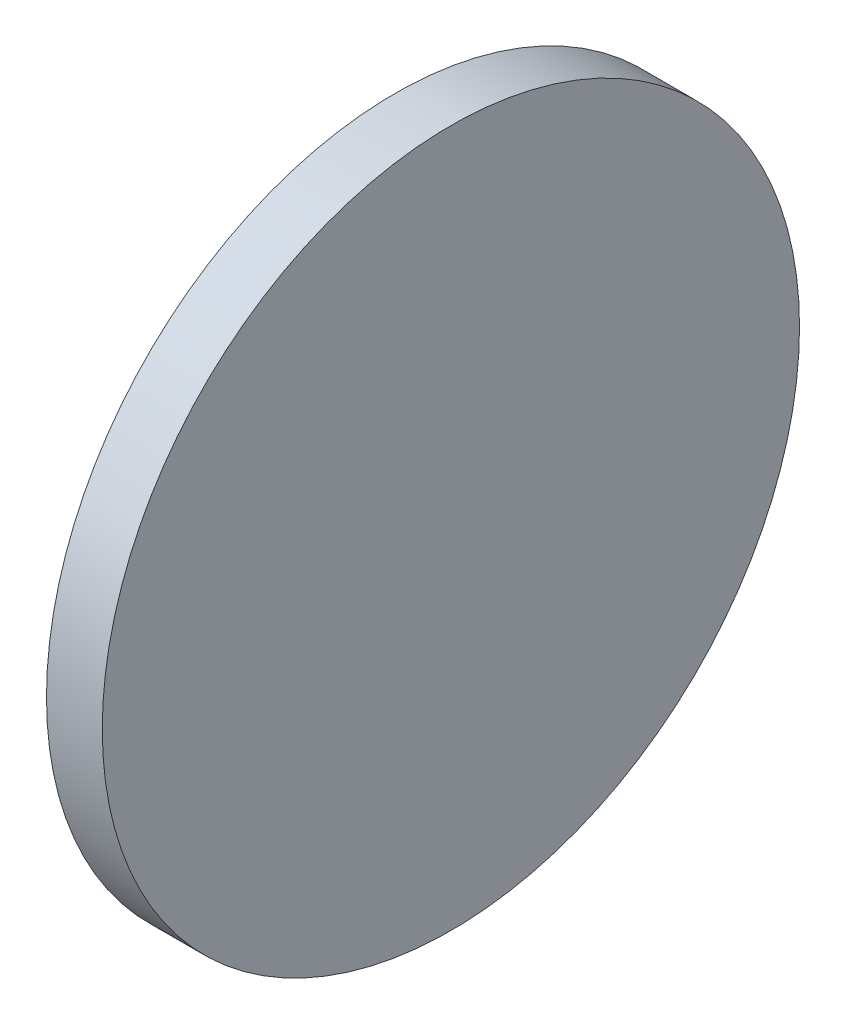
ISO-10303-21;
HEADER;
FILE_DESCRIPTION(('STEP AP214'),'2;1');
FILE_NAME('part.step','',(''),(''),'','','');
FILE_SCHEMA(('AUTOMOTIVE_DESIGN { 1 0 10303 214 1 1 1 1 }'));
ENDSEC;
DATA;
#1=APPLICATION_CONTEXT('core data for automotive mechanical design processes');
#2=APPLICATION_PROTOCOL_DEFINITION('international standard','automotive_design',2000,#1);
#3=PRODUCT_CONTEXT('',#1,'mechanical');
#4=PRODUCT('Part','Part','',(#3));
#5=PRODUCT_RELATED_PRODUCT_CATEGORY('part','',(#4));
#6=PRODUCT_DEFINITION_FORMATION('','',#4);
#7=PRODUCT_DEFINITION_CONTEXT('part definition',#1,'design');
#8=PRODUCT_DEFINITION('design','',#6,#7);
#9=PRODUCT_DEFINITION_SHAPE('','',#8);
#10=(LENGTH_UNIT() NAMED_UNIT(*) SI_UNIT(.MILLI.,.METRE.));
#11=(NAMED_UNIT(*) PLANE_ANGLE_UNIT() SI_UNIT($,.RADIAN.));
#12=(NAMED_UNIT(*) SI_UNIT($,.STERADIAN.) SOLID_ANGLE_UNIT());
#13=UNCERTAINTY_MEASURE_WITH_UNIT(LENGTH_MEASURE(1.E-05),#10,'distance_accuracy_value','');
#14=(GEOMETRIC_REPRESENTATION_CONTEXT(3) GLOBAL_UNCERTAINTY_ASSIGNED_CONTEXT((#13)) GLOBAL_UNIT_ASSIGNED_CONTEXT((#10,
#11,#12)) REPRESENTATION_CONTEXT('',''));
#15=CARTESIAN_POINT('',(0.,0.,0.));
#16=DIRECTION('',(0.,0.,1.));
#17=DIRECTION('',(1.,0.,0.));
#18=AXIS2_PLACEMENT_3D('',#15,#16,#17);
#19=CARTESIAN_POINT('',(260.286208168476,77.2931793490154,0.));
#20=DIRECTION('',(1.,0.,0.));
#21=DIRECTION('',(0.,0.,-1.));
#22=AXIS2_PLACEMENT_3D('',#19,#20,#21);
#23=PLANE('',#22);
#24=CARTESIAN_POINT('',(260.286208168476,77.2931793490154,0.));
#25=DIRECTION('',(-1.,0.,0.));
#26=DIRECTION('',(0.,0.,1.));
#27=AXIS2_PLACEMENT_3D('',#24,#25,#26);
#28=CIRCLE('',#27,12.5);
#29=CARTESIAN_POINT('',(260.286208168476,77.2931793490154,12.5));
#30=VERTEX_POINT('',#29);
#31=EDGE_CURVE('E10',#30,#30,#28,.T.);
#32=ORIENTED_EDGE('',*,*,#31,.T.);
#33=EDGE_LOOP('',(#32));
#34=FACE_BOUND('',#33,.T.);
#35=ADVANCED_FACE('F35',(#34),#23,.F.);
#36=CARTESIAN_POINT('',(254.000801992616,77.2931793490154,0.));
#37=DIRECTION('',(-1.,0.,0.));
#38=DIRECTION('',(0.,0.,1.));
#39=AXIS2_PLACEMENT_3D('',#36,#37,#38);
#40=CYLINDRICAL_SURFACE('',#39,12.5);
#41=ORIENTED_EDGE('',*,*,#31,.F.);
#42=EDGE_LOOP('',(#41));
#43=FACE_BOUND('',#42,.T.);
#44=CARTESIAN_POINT('',(262.286208168476,77.2931793490154,0.));
#45=DIRECTION('',(-1.,0.,0.));
#46=DIRECTION('',(0.,0.,1.));
#47=AXIS2_PLACEMENT_3D('',#44,#45,#46);
#48=CIRCLE('',#47,12.5);
#49=CARTESIAN_POINT('',(262.286208168476,77.2931793490154,12.5));
#50=VERTEX_POINT('',#49);
#51=EDGE_CURVE('E41',#50,#50,#48,.T.);
#52=ORIENTED_EDGE('',*,*,#51,.T.);
#53=EDGE_LOOP('',(#52));
#54=FACE_BOUND('',#53,.T.);
#55=ADVANCED_FACE('F47',(#43,#54),#40,.T.);
#56=CARTESIAN_POINT('',(262.286208168476,89.7931793490154,0.));
#57=DIRECTION('',(-1.,0.,0.));
#58=DIRECTION('',(0.,0.,1.));
#59=AXIS2_PLACEMENT_3D('',#56,#57,#58);
#60=PLANE('',#59);
#61=ORIENTED_EDGE('',*,*,#51,.F.);
#62=EDGE_LOOP('',(#61));
#63=FACE_BOUND('',#62,.T.);
#64=ADVANCED_FACE('F49',(#63),#60,.F.);
#65=CLOSED_SHELL('',(#35,#55,#64));
#66=MANIFOLD_SOLID_BREP('B2',#65);
#67=ADVANCED_BREP_SHAPE_REPRESENTATION('',(#18,#66),#14);
#68=SHAPE_DEFINITION_REPRESENTATION(#9,#67);
ENDSEC;
END-ISO-10303-21;
